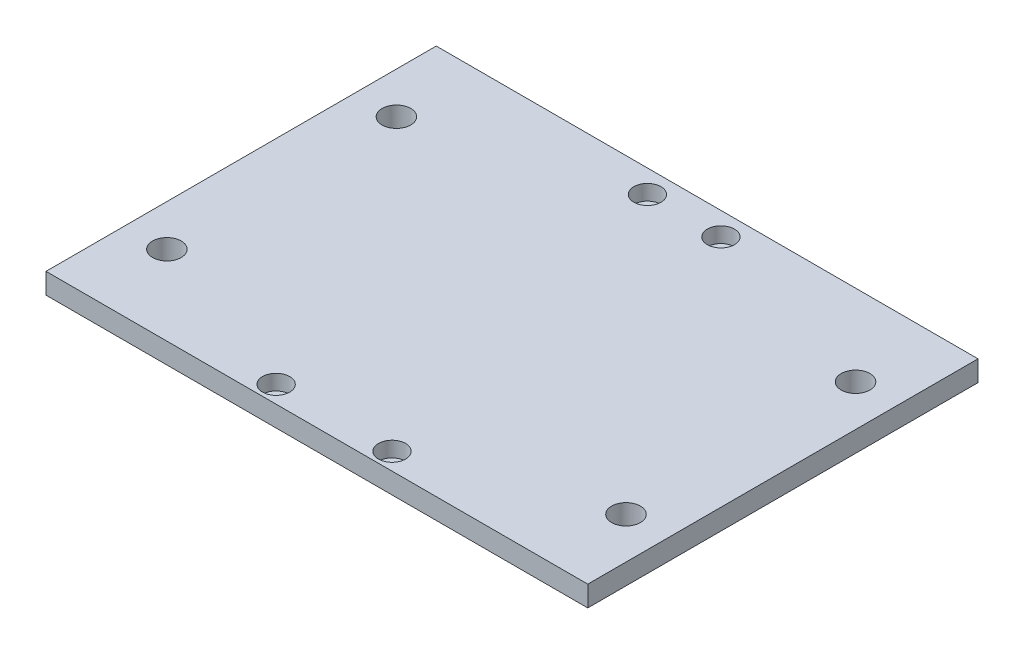
ISO-10303-21;
HEADER;
FILE_DESCRIPTION(('STEP AP214'),'2;1');
FILE_NAME('part.step','',(''),(''),'','','');
FILE_SCHEMA(('AUTOMOTIVE_DESIGN { 1 0 10303 214 1 1 1 1 }'));
ENDSEC;
DATA;
#1=APPLICATION_CONTEXT('core data for automotive mechanical design processes');
#2=APPLICATION_PROTOCOL_DEFINITION('international standard','automotive_design',2000,#1);
#3=PRODUCT_CONTEXT('',#1,'mechanical');
#4=PRODUCT('Part','Part','',(#3));
#5=PRODUCT_RELATED_PRODUCT_CATEGORY('part','',(#4));
#6=PRODUCT_DEFINITION_FORMATION('','',#4);
#7=PRODUCT_DEFINITION_CONTEXT('part definition',#1,'design');
#8=PRODUCT_DEFINITION('design','',#6,#7);
#9=PRODUCT_DEFINITION_SHAPE('','',#8);
#10=(LENGTH_UNIT() NAMED_UNIT(*) SI_UNIT(.MILLI.,.METRE.));
#11=(NAMED_UNIT(*) PLANE_ANGLE_UNIT() SI_UNIT($,.RADIAN.));
#12=(NAMED_UNIT(*) SI_UNIT($,.STERADIAN.) SOLID_ANGLE_UNIT());
#13=UNCERTAINTY_MEASURE_WITH_UNIT(LENGTH_MEASURE(1.E-05),#10,'distance_accuracy_value','');
#14=(GEOMETRIC_REPRESENTATION_CONTEXT(3) GLOBAL_UNCERTAINTY_ASSIGNED_CONTEXT((#13)) GLOBAL_UNIT_ASSIGNED_CONTEXT((#10,
#11,#12)) REPRESENTATION_CONTEXT('',''));
#15=CARTESIAN_POINT('',(0.,0.,0.));
#16=DIRECTION('',(0.,0.,1.));
#17=DIRECTION('',(1.,0.,0.));
#18=AXIS2_PLACEMENT_3D('',#15,#16,#17);
#19=CARTESIAN_POINT('',(-59.944,4.572,-43.18));
#20=DIRECTION('',(1.,0.,0.));
#21=DIRECTION('',(0.,0.,-1.));
#22=AXIS2_PLACEMENT_3D('',#19,#20,#21);
#23=PLANE('',#22);
#24=DIRECTION('',(0.,0.,1.));
#25=VECTOR('',#24,1.);
#26=CARTESIAN_POINT('',(-59.944,0.,-43.18));
#27=LINE('',#26,#25);
#28=CARTESIAN_POINT('',(-59.944,0.,-43.18));
#29=VERTEX_POINT('',#28);
#30=CARTESIAN_POINT('',(-59.944,0.,43.18));
#31=VERTEX_POINT('',#30);
#32=EDGE_CURVE('E97',#29,#31,#27,.T.);
#33=ORIENTED_EDGE('',*,*,#32,.T.);
#34=DIRECTION('',(0.,-1.,0.));
#35=VECTOR('',#34,1.);
#36=CARTESIAN_POINT('',(-59.944,4.572,43.18));
#37=LINE('',#36,#35);
#38=CARTESIAN_POINT('',(-59.944,4.572,43.18));
#39=VERTEX_POINT('',#38);
#40=EDGE_CURVE('E11',#39,#31,#37,.T.);
#41=ORIENTED_EDGE('',*,*,#40,.F.);
#42=DIRECTION('',(0.,0.,1.));
#43=VECTOR('',#42,1.);
#44=CARTESIAN_POINT('',(-59.944,4.572,-43.18));
#45=LINE('',#44,#43);
#46=CARTESIAN_POINT('',(-59.944,4.572,-43.18));
#47=VERTEX_POINT('',#46);
#48=EDGE_CURVE('E85',#47,#39,#45,.T.);
#49=ORIENTED_EDGE('',*,*,#48,.F.);
#50=DIRECTION('',(0.,-1.,0.));
#51=VECTOR('',#50,1.);
#52=CARTESIAN_POINT('',(-59.944,4.572,-43.18));
#53=LINE('',#52,#51);
#54=EDGE_CURVE('E93',#47,#29,#53,.T.);
#55=ORIENTED_EDGE('',*,*,#54,.T.);
#56=EDGE_LOOP('',(#33,#41,#49,#55));
#57=FACE_BOUND('',#56,.T.);
#58=ADVANCED_FACE('F34',(#57),#23,.F.);
#59=CARTESIAN_POINT('',(59.944,4.572,43.18));
#60=DIRECTION('',(0.,0.,-1.));
#61=DIRECTION('',(-1.,0.,0.));
#62=AXIS2_PLACEMENT_3D('',#59,#60,#61);
#63=PLANE('',#62);
#64=DIRECTION('',(1.,0.,0.));
#65=VECTOR('',#64,1.);
#66=CARTESIAN_POINT('',(59.944,0.,43.18));
#67=LINE('',#66,#65);
#68=CARTESIAN_POINT('',(59.944,0.,43.18));
#69=VERTEX_POINT('',#68);
#70=EDGE_CURVE('E89',#31,#69,#67,.T.);
#71=ORIENTED_EDGE('',*,*,#70,.T.);
#72=DIRECTION('',(0.,-1.,0.));
#73=VECTOR('',#72,1.);
#74=CARTESIAN_POINT('',(59.944,4.572,43.18));
#75=LINE('',#74,#73);
#76=CARTESIAN_POINT('',(59.944,4.572,43.18));
#77=VERTEX_POINT('',#76);
#78=EDGE_CURVE('E42',#77,#69,#75,.T.);
#79=ORIENTED_EDGE('',*,*,#78,.F.);
#80=DIRECTION('',(1.,0.,0.));
#81=VECTOR('',#80,1.);
#82=CARTESIAN_POINT('',(59.944,4.572,43.18));
#83=LINE('',#82,#81);
#84=EDGE_CURVE('E80',#39,#77,#83,.T.);
#85=ORIENTED_EDGE('',*,*,#84,.F.);
#86=ORIENTED_EDGE('',*,*,#40,.T.);
#87=EDGE_LOOP('',(#71,#79,#85,#86));
#88=FACE_BOUND('',#87,.T.);
#89=ADVANCED_FACE('F88',(#88),#63,.F.);
#90=CARTESIAN_POINT('',(59.944,4.572,-43.18));
#91=DIRECTION('',(-1.,0.,0.));
#92=DIRECTION('',(0.,0.,1.));
#93=AXIS2_PLACEMENT_3D('',#90,#91,#92);
#94=PLANE('',#93);
#95=DIRECTION('',(0.,0.,-1.));
#96=VECTOR('',#95,1.);
#97=CARTESIAN_POINT('',(59.944,0.,-43.18));
#98=LINE('',#97,#96);
#99=CARTESIAN_POINT('',(59.944,0.,-43.18));
#100=VERTEX_POINT('',#99);
#101=EDGE_CURVE('E67',#69,#100,#98,.T.);
#102=ORIENTED_EDGE('',*,*,#101,.T.);
#103=DIRECTION('',(0.,-1.,0.));
#104=VECTOR('',#103,1.);
#105=CARTESIAN_POINT('',(59.944,4.572,-43.18));
#106=LINE('',#105,#104);
#107=CARTESIAN_POINT('',(59.944,4.572,-43.18));
#108=VERTEX_POINT('',#107);
#109=EDGE_CURVE('E90',#108,#100,#106,.T.);
#110=ORIENTED_EDGE('',*,*,#109,.F.);
#111=DIRECTION('',(0.,0.,-1.));
#112=VECTOR('',#111,1.);
#113=CARTESIAN_POINT('',(59.944,4.572,-43.18));
#114=LINE('',#113,#112);
#115=EDGE_CURVE('E83',#77,#108,#114,.T.);
#116=ORIENTED_EDGE('',*,*,#115,.F.);
#117=ORIENTED_EDGE('',*,*,#78,.T.);
#118=EDGE_LOOP('',(#102,#110,#116,#117));
#119=FACE_BOUND('',#118,.T.);
#120=ADVANCED_FACE('F91',(#119),#94,.F.);
#121=CARTESIAN_POINT('',(59.944,4.572,-43.18));
#122=DIRECTION('',(0.,0.,1.));
#123=DIRECTION('',(1.,0.,0.));
#124=AXIS2_PLACEMENT_3D('',#121,#122,#123);
#125=PLANE('',#124);
#126=DIRECTION('',(-1.,0.,0.));
#127=VECTOR('',#126,1.);
#128=CARTESIAN_POINT('',(59.944,0.,-43.18));
#129=LINE('',#128,#127);
#130=EDGE_CURVE('E73',#100,#29,#129,.T.);
#131=ORIENTED_EDGE('',*,*,#130,.T.);
#132=ORIENTED_EDGE('',*,*,#54,.F.);
#133=DIRECTION('',(-1.,0.,0.));
#134=VECTOR('',#133,1.);
#135=CARTESIAN_POINT('',(59.944,4.572,-43.18));
#136=LINE('',#135,#134);
#137=EDGE_CURVE('E50',#108,#47,#136,.T.);
#138=ORIENTED_EDGE('',*,*,#137,.F.);
#139=ORIENTED_EDGE('',*,*,#109,.T.);
#140=EDGE_LOOP('',(#131,#132,#138,#139));
#141=FACE_BOUND('',#140,.T.);
#142=ADVANCED_FACE('F105',(#141),#125,.F.);
#143=CARTESIAN_POINT('',(0.,4.572,0.));
#144=DIRECTION('',(0.,-1.,0.));
#145=DIRECTION('',(0.,0.,-1.));
#146=AXIS2_PLACEMENT_3D('',#143,#144,#145);
#147=PLANE('',#146);
#148=CARTESIAN_POINT('',(50.8,4.572,25.5742866480706));
#149=DIRECTION('',(0.,1.,0.));
#150=DIRECTION('',(0.,0.,1.));
#151=AXIS2_PLACEMENT_3D('',#148,#149,#150);
#152=CIRCLE('',#151,3.175);
#153=CARTESIAN_POINT('',(50.8,4.572,28.7492866480706));
#154=VERTEX_POINT('',#153);
#155=EDGE_CURVE('E172',#154,#154,#152,.T.);
#156=ORIENTED_EDGE('',*,*,#155,.F.);
#157=EDGE_LOOP('',(#156));
#158=FACE_BOUND('',#157,.T.);
#159=CARTESIAN_POINT('',(-50.8,4.572,-25.2257133519294));
#160=DIRECTION('',(0.,1.,0.));
#161=DIRECTION('',(0.,0.,1.));
#162=AXIS2_PLACEMENT_3D('',#159,#160,#161);
#163=CIRCLE('',#162,3.175);
#164=CARTESIAN_POINT('',(-50.8,4.572,-22.0507133519294));
#165=VERTEX_POINT('',#164);
#166=EDGE_CURVE('E165',#165,#165,#163,.T.);
#167=ORIENTED_EDGE('',*,*,#166,.F.);
#168=EDGE_LOOP('',(#167));
#169=FACE_BOUND('',#168,.T.);
#170=CARTESIAN_POINT('',(-50.8,4.572,25.5742866480706));
#171=DIRECTION('',(0.,1.,0.));
#172=DIRECTION('',(0.,0.,1.));
#173=AXIS2_PLACEMENT_3D('',#170,#171,#172);
#174=CIRCLE('',#173,3.175);
#175=CARTESIAN_POINT('',(-50.8,4.572,28.7492866480706));
#176=VERTEX_POINT('',#175);
#177=EDGE_CURVE('E177',#176,#176,#174,.T.);
#178=ORIENTED_EDGE('',*,*,#177,.F.);
#179=EDGE_LOOP('',(#178));
#180=FACE_BOUND('',#179,.T.);
#181=CARTESIAN_POINT('',(50.8,4.572,-25.2257133519294));
#182=DIRECTION('',(0.,1.,0.));
#183=DIRECTION('',(0.,0.,1.));
#184=AXIS2_PLACEMENT_3D('',#181,#182,#183);
#185=CIRCLE('',#184,3.175);
#186=CARTESIAN_POINT('',(50.8,4.572,-22.0507133519294));
#187=VERTEX_POINT('',#186);
#188=EDGE_CURVE('E159',#187,#187,#185,.T.);
#189=ORIENTED_EDGE('',*,*,#188,.F.);
#190=EDGE_LOOP('',(#189));
#191=FACE_BOUND('',#190,.T.);
#192=CARTESIAN_POINT('',(8.128,4.572,-38.1));
#193=DIRECTION('',(0.,1.,0.));
#194=DIRECTION('',(0.,0.,1.));
#195=AXIS2_PLACEMENT_3D('',#192,#193,#194);
#196=CIRCLE('',#195,3.);
#197=CARTESIAN_POINT('',(8.128,4.572,-35.1));
#198=VERTEX_POINT('',#197);
#199=EDGE_CURVE('E155',#198,#198,#196,.T.);
#200=ORIENTED_EDGE('',*,*,#199,.F.);
#201=EDGE_LOOP('',(#200));
#202=FACE_BOUND('',#201,.T.);
#203=CARTESIAN_POINT('',(12.827,4.572,39.37));
#204=DIRECTION('',(0.,1.,0.));
#205=DIRECTION('',(0.,0.,1.));
#206=AXIS2_PLACEMENT_3D('',#203,#204,#205);
#207=CIRCLE('',#206,3.);
#208=CARTESIAN_POINT('',(12.827,4.572,42.37));
#209=VERTEX_POINT('',#208);
#210=EDGE_CURVE('E143',#209,#209,#207,.T.);
#211=ORIENTED_EDGE('',*,*,#210,.F.);
#212=EDGE_LOOP('',(#211));
#213=FACE_BOUND('',#212,.T.);
#214=CARTESIAN_POINT('',(-12.827,4.572,39.37));
#215=DIRECTION('',(0.,1.,0.));
#216=DIRECTION('',(0.,0.,1.));
#217=AXIS2_PLACEMENT_3D('',#214,#215,#216);
#218=CIRCLE('',#217,3.);
#219=CARTESIAN_POINT('',(-12.827,4.572,42.37));
#220=VERTEX_POINT('',#219);
#221=EDGE_CURVE('E131',#220,#220,#218,.T.);
#222=ORIENTED_EDGE('',*,*,#221,.F.);
#223=EDGE_LOOP('',(#222));
#224=FACE_BOUND('',#223,.T.);
#225=CARTESIAN_POINT('',(-8.128,4.572,-38.1));
#226=DIRECTION('',(0.,1.,0.));
#227=DIRECTION('',(0.,0.,1.));
#228=AXIS2_PLACEMENT_3D('',#225,#226,#227);
#229=CIRCLE('',#228,3.);
#230=CARTESIAN_POINT('',(-8.128,4.572,-35.1));
#231=VERTEX_POINT('',#230);
#232=EDGE_CURVE('E119',#231,#231,#229,.T.);
#233=ORIENTED_EDGE('',*,*,#232,.F.);
#234=EDGE_LOOP('',(#233));
#235=FACE_BOUND('',#234,.T.);
#236=ORIENTED_EDGE('',*,*,#48,.T.);
#237=ORIENTED_EDGE('',*,*,#84,.T.);
#238=ORIENTED_EDGE('',*,*,#115,.T.);
#239=ORIENTED_EDGE('',*,*,#137,.T.);
#240=EDGE_LOOP('',(#236,#237,#238,#239));
#241=FACE_BOUND('',#240,.T.);
#242=ADVANCED_FACE('F81',(#158,#169,#180,#191,#202,#213,#224,#235,#241),#147,.F.);
#243=CARTESIAN_POINT('',(0.,0.,0.));
#244=DIRECTION('',(0.,-1.,0.));
#245=DIRECTION('',(0.,0.,-1.));
#246=AXIS2_PLACEMENT_3D('',#243,#244,#245);
#247=PLANE('',#246);
#248=CARTESIAN_POINT('',(50.8,0.,25.5742866480706));
#249=DIRECTION('',(0.,1.,0.));
#250=DIRECTION('',(0.,0.,1.));
#251=AXIS2_PLACEMENT_3D('',#248,#249,#250);
#252=CIRCLE('',#251,3.175);
#253=CARTESIAN_POINT('',(50.8,0.,28.7492866480706));
#254=VERTEX_POINT('',#253);
#255=EDGE_CURVE('E162',#254,#254,#252,.T.);
#256=ORIENTED_EDGE('',*,*,#255,.T.);
#257=EDGE_LOOP('',(#256));
#258=FACE_BOUND('',#257,.T.);
#259=CARTESIAN_POINT('',(-50.8,0.,-25.2257133519294));
#260=DIRECTION('',(0.,1.,0.));
#261=DIRECTION('',(0.,0.,1.));
#262=AXIS2_PLACEMENT_3D('',#259,#260,#261);
#263=CIRCLE('',#262,3.175);
#264=CARTESIAN_POINT('',(-50.8,0.,-22.0507133519294));
#265=VERTEX_POINT('',#264);
#266=EDGE_CURVE('E168',#265,#265,#263,.T.);
#267=ORIENTED_EDGE('',*,*,#266,.T.);
#268=EDGE_LOOP('',(#267));
#269=FACE_BOUND('',#268,.T.);
#270=CARTESIAN_POINT('',(-50.8,0.,25.5742866480706));
#271=DIRECTION('',(0.,1.,0.));
#272=DIRECTION('',(0.,0.,1.));
#273=AXIS2_PLACEMENT_3D('',#270,#271,#272);
#274=CIRCLE('',#273,3.175);
#275=CARTESIAN_POINT('',(-50.8,0.,28.7492866480706));
#276=VERTEX_POINT('',#275);
#277=EDGE_CURVE('E169',#276,#276,#274,.T.);
#278=ORIENTED_EDGE('',*,*,#277,.T.);
#279=EDGE_LOOP('',(#278));
#280=FACE_BOUND('',#279,.T.);
#281=CARTESIAN_POINT('',(50.8,0.,-25.2257133519294));
#282=DIRECTION('',(0.,1.,0.));
#283=DIRECTION('',(0.,0.,1.));
#284=AXIS2_PLACEMENT_3D('',#281,#282,#283);
#285=CIRCLE('',#284,3.175);
#286=CARTESIAN_POINT('',(50.8,0.,-22.0507133519294));
#287=VERTEX_POINT('',#286);
#288=EDGE_CURVE('E158',#287,#287,#285,.T.);
#289=ORIENTED_EDGE('',*,*,#288,.T.);
#290=EDGE_LOOP('',(#289));
#291=FACE_BOUND('',#290,.T.);
#292=CARTESIAN_POINT('',(8.128,0.,-38.1));
#293=DIRECTION('',(0.,1.,0.));
#294=DIRECTION('',(0.,0.,1.));
#295=AXIS2_PLACEMENT_3D('',#292,#293,#294);
#296=CIRCLE('',#295,1.7);
#297=CARTESIAN_POINT('',(8.128,0.,-36.4));
#298=VERTEX_POINT('',#297);
#299=EDGE_CURVE('E146',#298,#298,#296,.T.);
#300=ORIENTED_EDGE('',*,*,#299,.T.);
#301=EDGE_LOOP('',(#300));
#302=FACE_BOUND('',#301,.T.);
#303=CARTESIAN_POINT('',(12.827,0.,39.37));
#304=DIRECTION('',(0.,1.,0.));
#305=DIRECTION('',(0.,0.,1.));
#306=AXIS2_PLACEMENT_3D('',#303,#304,#305);
#307=CIRCLE('',#306,1.7);
#308=CARTESIAN_POINT('',(12.827,0.,41.07));
#309=VERTEX_POINT('',#308);
#310=EDGE_CURVE('E134',#309,#309,#307,.T.);
#311=ORIENTED_EDGE('',*,*,#310,.T.);
#312=EDGE_LOOP('',(#311));
#313=FACE_BOUND('',#312,.T.);
#314=CARTESIAN_POINT('',(-12.827,0.,39.37));
#315=DIRECTION('',(0.,1.,0.));
#316=DIRECTION('',(0.,0.,1.));
#317=AXIS2_PLACEMENT_3D('',#314,#315,#316);
#318=CIRCLE('',#317,1.7);
#319=CARTESIAN_POINT('',(-12.827,0.,41.07));
#320=VERTEX_POINT('',#319);
#321=EDGE_CURVE('E122',#320,#320,#318,.T.);
#322=ORIENTED_EDGE('',*,*,#321,.T.);
#323=EDGE_LOOP('',(#322));
#324=FACE_BOUND('',#323,.T.);
#325=CARTESIAN_POINT('',(-8.128,0.,-38.1));
#326=DIRECTION('',(0.,1.,0.));
#327=DIRECTION('',(0.,0.,1.));
#328=AXIS2_PLACEMENT_3D('',#325,#326,#327);
#329=CIRCLE('',#328,1.7);
#330=CARTESIAN_POINT('',(-8.128,0.,-36.4));
#331=VERTEX_POINT('',#330);
#332=EDGE_CURVE('E100',#331,#331,#329,.T.);
#333=ORIENTED_EDGE('',*,*,#332,.T.);
#334=EDGE_LOOP('',(#333));
#335=FACE_BOUND('',#334,.T.);
#336=ORIENTED_EDGE('',*,*,#32,.F.);
#337=ORIENTED_EDGE('',*,*,#130,.F.);
#338=ORIENTED_EDGE('',*,*,#101,.F.);
#339=ORIENTED_EDGE('',*,*,#70,.F.);
#340=EDGE_LOOP('',(#336,#337,#338,#339));
#341=FACE_BOUND('',#340,.T.);
#342=ADVANCED_FACE('F108',(#258,#269,#280,#291,#302,#313,#324,#335,#341),#247,.T.);
#343=CARTESIAN_POINT('',(-8.128,4.572,-38.1));
#344=DIRECTION('',(0.,1.,0.));
#345=DIRECTION('',(0.,0.,1.));
#346=AXIS2_PLACEMENT_3D('',#343,#344,#345);
#347=CYLINDRICAL_SURFACE('',#346,1.7);
#348=ORIENTED_EDGE('',*,*,#332,.F.);
#349=EDGE_LOOP('',(#348));
#350=FACE_BOUND('',#349,.T.);
#351=CARTESIAN_POINT('',(-8.128,1.172,-38.1));
#352=DIRECTION('',(0.,1.,0.));
#353=DIRECTION('',(0.,0.,1.));
#354=AXIS2_PLACEMENT_3D('',#351,#352,#353);
#355=CIRCLE('',#354,1.7);
#356=CARTESIAN_POINT('',(-8.128,1.172,-36.4));
#357=VERTEX_POINT('',#356);
#358=EDGE_CURVE('E113',#357,#357,#355,.T.);
#359=ORIENTED_EDGE('',*,*,#358,.T.);
#360=EDGE_LOOP('',(#359));
#361=FACE_BOUND('',#360,.T.);
#362=ADVANCED_FACE('F220',(#350,#361),#347,.F.);
#363=CARTESIAN_POINT('',(-6.428,1.172,-38.1));
#364=DIRECTION('',(0.,-1.,0.));
#365=DIRECTION('',(0.,0.,-1.));
#366=AXIS2_PLACEMENT_3D('',#363,#364,#365);
#367=PLANE('',#366);
#368=ORIENTED_EDGE('',*,*,#358,.F.);
#369=EDGE_LOOP('',(#368));
#370=FACE_BOUND('',#369,.T.);
#371=CARTESIAN_POINT('',(-8.128,1.172,-38.1));
#372=DIRECTION('',(0.,1.,0.));
#373=DIRECTION('',(0.,0.,1.));
#374=AXIS2_PLACEMENT_3D('',#371,#372,#373);
#375=CIRCLE('',#374,3.);
#376=CARTESIAN_POINT('',(-8.128,1.172,-35.1));
#377=VERTEX_POINT('',#376);
#378=EDGE_CURVE('E116',#377,#377,#375,.T.);
#379=ORIENTED_EDGE('',*,*,#378,.T.);
#380=EDGE_LOOP('',(#379));
#381=FACE_BOUND('',#380,.T.);
#382=ADVANCED_FACE('F210',(#370,#381),#367,.F.);
#383=CARTESIAN_POINT('',(-8.128,4.572,-38.1));
#384=DIRECTION('',(0.,1.,0.));
#385=DIRECTION('',(0.,0.,1.));
#386=AXIS2_PLACEMENT_3D('',#383,#384,#385);
#387=CYLINDRICAL_SURFACE('',#386,3.);
#388=ORIENTED_EDGE('',*,*,#378,.F.);
#389=EDGE_LOOP('',(#388));
#390=FACE_BOUND('',#389,.T.);
#391=ORIENTED_EDGE('',*,*,#232,.T.);
#392=EDGE_LOOP('',(#391));
#393=FACE_BOUND('',#392,.T.);
#394=ADVANCED_FACE('F207',(#390,#393),#387,.F.);
#395=CARTESIAN_POINT('',(-12.827,4.572,39.37));
#396=DIRECTION('',(0.,1.,0.));
#397=DIRECTION('',(0.,0.,1.));
#398=AXIS2_PLACEMENT_3D('',#395,#396,#397);
#399=CYLINDRICAL_SURFACE('',#398,1.7);
#400=ORIENTED_EDGE('',*,*,#321,.F.);
#401=EDGE_LOOP('',(#400));
#402=FACE_BOUND('',#401,.T.);
#403=CARTESIAN_POINT('',(-12.827,1.172,39.37));
#404=DIRECTION('',(0.,1.,0.));
#405=DIRECTION('',(0.,0.,1.));
#406=AXIS2_PLACEMENT_3D('',#403,#404,#405);
#407=CIRCLE('',#406,1.7);
#408=CARTESIAN_POINT('',(-12.827,1.172,41.07));
#409=VERTEX_POINT('',#408);
#410=EDGE_CURVE('E125',#409,#409,#407,.T.);
#411=ORIENTED_EDGE('',*,*,#410,.T.);
#412=EDGE_LOOP('',(#411));
#413=FACE_BOUND('',#412,.T.);
#414=ADVANCED_FACE('F209',(#402,#413),#399,.F.);
#415=CARTESIAN_POINT('',(-11.127,1.172,39.37));
#416=DIRECTION('',(0.,-1.,0.));
#417=DIRECTION('',(0.,0.,-1.));
#418=AXIS2_PLACEMENT_3D('',#415,#416,#417);
#419=PLANE('',#418);
#420=ORIENTED_EDGE('',*,*,#410,.F.);
#421=EDGE_LOOP('',(#420));
#422=FACE_BOUND('',#421,.T.);
#423=CARTESIAN_POINT('',(-12.827,1.172,39.37));
#424=DIRECTION('',(0.,1.,0.));
#425=DIRECTION('',(0.,0.,1.));
#426=AXIS2_PLACEMENT_3D('',#423,#424,#425);
#427=CIRCLE('',#426,3.);
#428=CARTESIAN_POINT('',(-12.827,1.172,42.37));
#429=VERTEX_POINT('',#428);
#430=EDGE_CURVE('E128',#429,#429,#427,.T.);
#431=ORIENTED_EDGE('',*,*,#430,.T.);
#432=EDGE_LOOP('',(#431));
#433=FACE_BOUND('',#432,.T.);
#434=ADVANCED_FACE('F217',(#422,#433),#419,.F.);
#435=CARTESIAN_POINT('',(-12.827,4.572,39.37));
#436=DIRECTION('',(0.,1.,0.));
#437=DIRECTION('',(0.,0.,1.));
#438=AXIS2_PLACEMENT_3D('',#435,#436,#437);
#439=CYLINDRICAL_SURFACE('',#438,3.);
#440=ORIENTED_EDGE('',*,*,#430,.F.);
#441=EDGE_LOOP('',(#440));
#442=FACE_BOUND('',#441,.T.);
#443=ORIENTED_EDGE('',*,*,#221,.T.);
#444=EDGE_LOOP('',(#443));
#445=FACE_BOUND('',#444,.T.);
#446=ADVANCED_FACE('F273',(#442,#445),#439,.F.);
#447=CARTESIAN_POINT('',(12.827,4.572,39.37));
#448=DIRECTION('',(0.,1.,0.));
#449=DIRECTION('',(0.,0.,1.));
#450=AXIS2_PLACEMENT_3D('',#447,#448,#449);
#451=CYLINDRICAL_SURFACE('',#450,1.7);
#452=ORIENTED_EDGE('',*,*,#310,.F.);
#453=EDGE_LOOP('',(#452));
#454=FACE_BOUND('',#453,.T.);
#455=CARTESIAN_POINT('',(12.827,1.172,39.37));
#456=DIRECTION('',(0.,1.,0.));
#457=DIRECTION('',(0.,0.,1.));
#458=AXIS2_PLACEMENT_3D('',#455,#456,#457);
#459=CIRCLE('',#458,1.7);
#460=CARTESIAN_POINT('',(12.827,1.172,41.07));
#461=VERTEX_POINT('',#460);
#462=EDGE_CURVE('E137',#461,#461,#459,.T.);
#463=ORIENTED_EDGE('',*,*,#462,.T.);
#464=EDGE_LOOP('',(#463));
#465=FACE_BOUND('',#464,.T.);
#466=ADVANCED_FACE('F283',(#454,#465),#451,.F.);
#467=CARTESIAN_POINT('',(14.527,1.172,39.37));
#468=DIRECTION('',(0.,-1.,0.));
#469=DIRECTION('',(0.,0.,-1.));
#470=AXIS2_PLACEMENT_3D('',#467,#468,#469);
#471=PLANE('',#470);
#472=ORIENTED_EDGE('',*,*,#462,.F.);
#473=EDGE_LOOP('',(#472));
#474=FACE_BOUND('',#473,.T.);
#475=CARTESIAN_POINT('',(12.827,1.172,39.37));
#476=DIRECTION('',(0.,1.,0.));
#477=DIRECTION('',(0.,0.,1.));
#478=AXIS2_PLACEMENT_3D('',#475,#476,#477);
#479=CIRCLE('',#478,3.);
#480=CARTESIAN_POINT('',(12.827,1.172,42.37));
#481=VERTEX_POINT('',#480);
#482=EDGE_CURVE('E140',#481,#481,#479,.T.);
#483=ORIENTED_EDGE('',*,*,#482,.T.);
#484=EDGE_LOOP('',(#483));
#485=FACE_BOUND('',#484,.T.);
#486=ADVANCED_FACE('F293',(#474,#485),#471,.F.);
#487=CARTESIAN_POINT('',(12.827,4.572,39.37));
#488=DIRECTION('',(0.,1.,0.));
#489=DIRECTION('',(0.,0.,1.));
#490=AXIS2_PLACEMENT_3D('',#487,#488,#489);
#491=CYLINDRICAL_SURFACE('',#490,3.);
#492=ORIENTED_EDGE('',*,*,#482,.F.);
#493=EDGE_LOOP('',(#492));
#494=FACE_BOUND('',#493,.T.);
#495=ORIENTED_EDGE('',*,*,#210,.T.);
#496=EDGE_LOOP('',(#495));
#497=FACE_BOUND('',#496,.T.);
#498=ADVANCED_FACE('F303',(#494,#497),#491,.F.);
#499=CARTESIAN_POINT('',(8.128,4.572,-38.1));
#500=DIRECTION('',(0.,1.,0.));
#501=DIRECTION('',(0.,0.,1.));
#502=AXIS2_PLACEMENT_3D('',#499,#500,#501);
#503=CYLINDRICAL_SURFACE('',#502,1.7);
#504=ORIENTED_EDGE('',*,*,#299,.F.);
#505=EDGE_LOOP('',(#504));
#506=FACE_BOUND('',#505,.T.);
#507=CARTESIAN_POINT('',(8.128,1.172,-38.1));
#508=DIRECTION('',(0.,1.,0.));
#509=DIRECTION('',(0.,0.,1.));
#510=AXIS2_PLACEMENT_3D('',#507,#508,#509);
#511=CIRCLE('',#510,1.7);
#512=CARTESIAN_POINT('',(8.128,1.172,-36.4));
#513=VERTEX_POINT('',#512);
#514=EDGE_CURVE('E149',#513,#513,#511,.T.);
#515=ORIENTED_EDGE('',*,*,#514,.T.);
#516=EDGE_LOOP('',(#515));
#517=FACE_BOUND('',#516,.T.);
#518=ADVANCED_FACE('F313',(#506,#517),#503,.F.);
#519=CARTESIAN_POINT('',(9.828,1.172,-38.1));
#520=DIRECTION('',(0.,-1.,0.));
#521=DIRECTION('',(0.,0.,-1.));
#522=AXIS2_PLACEMENT_3D('',#519,#520,#521);
#523=PLANE('',#522);
#524=ORIENTED_EDGE('',*,*,#514,.F.);
#525=EDGE_LOOP('',(#524));
#526=FACE_BOUND('',#525,.T.);
#527=CARTESIAN_POINT('',(8.128,1.172,-38.1));
#528=DIRECTION('',(0.,1.,0.));
#529=DIRECTION('',(0.,0.,1.));
#530=AXIS2_PLACEMENT_3D('',#527,#528,#529);
#531=CIRCLE('',#530,3.);
#532=CARTESIAN_POINT('',(8.128,1.172,-35.1));
#533=VERTEX_POINT('',#532);
#534=EDGE_CURVE('E152',#533,#533,#531,.T.);
#535=ORIENTED_EDGE('',*,*,#534,.T.);
#536=EDGE_LOOP('',(#535));
#537=FACE_BOUND('',#536,.T.);
#538=ADVANCED_FACE('F323',(#526,#537),#523,.F.);
#539=CARTESIAN_POINT('',(8.128,4.572,-38.1));
#540=DIRECTION('',(0.,1.,0.));
#541=DIRECTION('',(0.,0.,1.));
#542=AXIS2_PLACEMENT_3D('',#539,#540,#541);
#543=CYLINDRICAL_SURFACE('',#542,3.);
#544=ORIENTED_EDGE('',*,*,#534,.F.);
#545=EDGE_LOOP('',(#544));
#546=FACE_BOUND('',#545,.T.);
#547=ORIENTED_EDGE('',*,*,#199,.T.);
#548=EDGE_LOOP('',(#547));
#549=FACE_BOUND('',#548,.T.);
#550=ADVANCED_FACE('F333',(#546,#549),#543,.F.);
#551=CARTESIAN_POINT('',(50.8,0.,-25.2257133519294));
#552=DIRECTION('',(0.,1.,0.));
#553=DIRECTION('',(0.,0.,1.));
#554=AXIS2_PLACEMENT_3D('',#551,#552,#553);
#555=CYLINDRICAL_SURFACE('',#554,3.175);
#556=ORIENTED_EDGE('',*,*,#288,.F.);
#557=EDGE_LOOP('',(#556));
#558=FACE_BOUND('',#557,.T.);
#559=ORIENTED_EDGE('',*,*,#188,.T.);
#560=EDGE_LOOP('',(#559));
#561=FACE_BOUND('',#560,.T.);
#562=ADVANCED_FACE('F189',(#558,#561),#555,.F.);
#563=CARTESIAN_POINT('',(-50.8,0.,25.5742866480706));
#564=DIRECTION('',(0.,1.,0.));
#565=DIRECTION('',(0.,0.,1.));
#566=AXIS2_PLACEMENT_3D('',#563,#564,#565);
#567=CYLINDRICAL_SURFACE('',#566,3.175);
#568=ORIENTED_EDGE('',*,*,#277,.F.);
#569=EDGE_LOOP('',(#568));
#570=FACE_BOUND('',#569,.T.);
#571=ORIENTED_EDGE('',*,*,#177,.T.);
#572=EDGE_LOOP('',(#571));
#573=FACE_BOUND('',#572,.T.);
#574=ADVANCED_FACE('F185',(#570,#573),#567,.F.);
#575=CARTESIAN_POINT('',(-50.8,0.,-25.2257133519294));
#576=DIRECTION('',(0.,1.,0.));
#577=DIRECTION('',(0.,0.,1.));
#578=AXIS2_PLACEMENT_3D('',#575,#576,#577);
#579=CYLINDRICAL_SURFACE('',#578,3.175);
#580=ORIENTED_EDGE('',*,*,#266,.F.);
#581=EDGE_LOOP('',(#580));
#582=FACE_BOUND('',#581,.T.);
#583=ORIENTED_EDGE('',*,*,#166,.T.);
#584=EDGE_LOOP('',(#583));
#585=FACE_BOUND('',#584,.T.);
#586=ADVANCED_FACE('F188',(#582,#585),#579,.F.);
#587=CARTESIAN_POINT('',(50.8,0.,25.5742866480706));
#588=DIRECTION('',(0.,1.,0.));
#589=DIRECTION('',(0.,0.,1.));
#590=AXIS2_PLACEMENT_3D('',#587,#588,#589);
#591=CYLINDRICAL_SURFACE('',#590,3.175);
#592=ORIENTED_EDGE('',*,*,#255,.F.);
#593=EDGE_LOOP('',(#592));
#594=FACE_BOUND('',#593,.T.);
#595=ORIENTED_EDGE('',*,*,#155,.T.);
#596=EDGE_LOOP('',(#595));
#597=FACE_BOUND('',#596,.T.);
#598=ADVANCED_FACE('F378',(#594,#597),#591,.F.);
#599=CLOSED_SHELL('',(#58,#89,#120,#142,#242,#342,#362,#382,#394,#414,#434,#446,#466,#486,#498,
#518,#538,#550,#562,#574,#586,#598));
#600=MANIFOLD_SOLID_BREP('B2',#599);
#601=ADVANCED_BREP_SHAPE_REPRESENTATION('',(#18,#600),#14);
#602=SHAPE_DEFINITION_REPRESENTATION(#9,#601);
ENDSEC;
END-ISO-10303-21;
